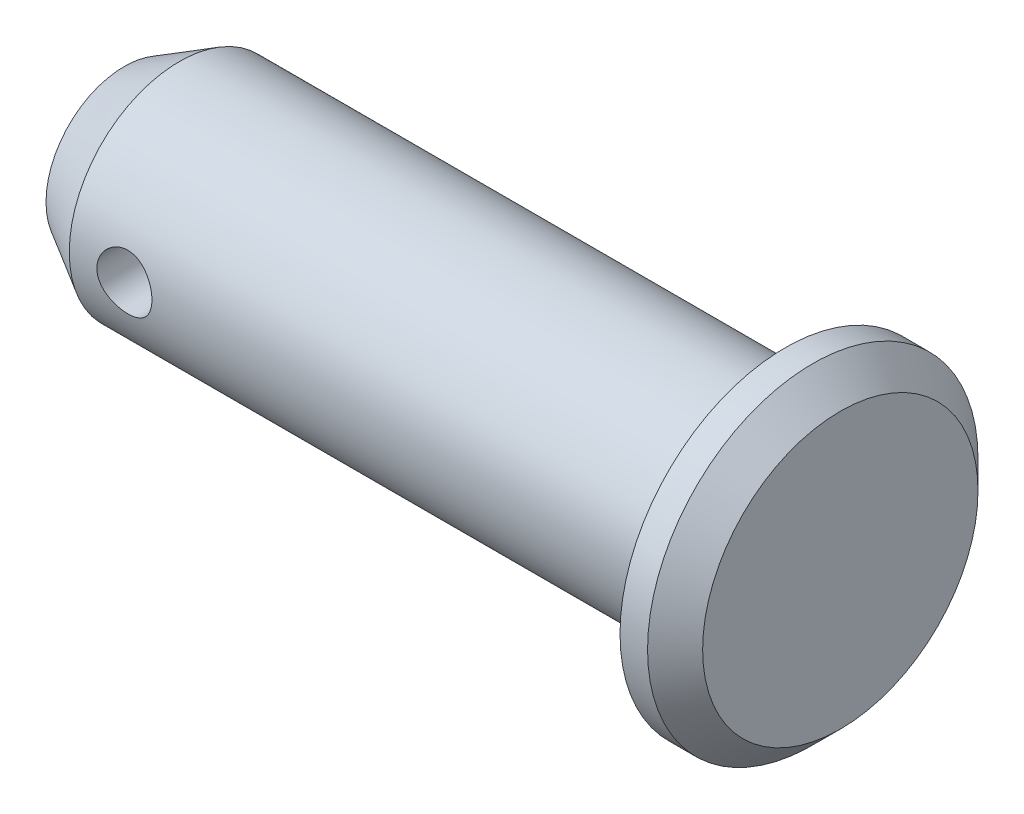
ISO-10303-21;
HEADER;
FILE_DESCRIPTION(('STEP AP214'),'2;1');
FILE_NAME('part.step','',(''),(''),'','','');
FILE_SCHEMA(('AUTOMOTIVE_DESIGN { 1 0 10303 214 1 1 1 1 }'));
ENDSEC;
DATA;
#1=APPLICATION_CONTEXT('core data for automotive mechanical design processes');
#2=APPLICATION_PROTOCOL_DEFINITION('international standard','automotive_design',2000,#1);
#3=PRODUCT_CONTEXT('',#1,'mechanical');
#4=PRODUCT('Part','Part','',(#3));
#5=PRODUCT_RELATED_PRODUCT_CATEGORY('part','',(#4));
#6=PRODUCT_DEFINITION_FORMATION('','',#4);
#7=PRODUCT_DEFINITION_CONTEXT('part definition',#1,'design');
#8=PRODUCT_DEFINITION('design','',#6,#7);
#9=PRODUCT_DEFINITION_SHAPE('','',#8);
#10=(LENGTH_UNIT() NAMED_UNIT(*) SI_UNIT(.MILLI.,.METRE.));
#11=(NAMED_UNIT(*) PLANE_ANGLE_UNIT() SI_UNIT($,.RADIAN.));
#12=(NAMED_UNIT(*) SI_UNIT($,.STERADIAN.) SOLID_ANGLE_UNIT());
#13=UNCERTAINTY_MEASURE_WITH_UNIT(LENGTH_MEASURE(1.E-05),#10,'distance_accuracy_value','');
#14=(GEOMETRIC_REPRESENTATION_CONTEXT(3) GLOBAL_UNCERTAINTY_ASSIGNED_CONTEXT((#13)) GLOBAL_UNIT_ASSIGNED_CONTEXT((#10,
#11,#12)) REPRESENTATION_CONTEXT('',''));
#15=CARTESIAN_POINT('',(0.,0.,0.));
#16=DIRECTION('',(0.,0.,1.));
#17=DIRECTION('',(1.,0.,0.));
#18=AXIS2_PLACEMENT_3D('',#15,#16,#17);
#19=CARTESIAN_POINT('',(-12.,0.,0.));
#20=DIRECTION('',(-1.,0.,0.));
#21=DIRECTION('',(0.,0.,1.));
#22=AXIS2_PLACEMENT_3D('',#19,#20,#21);
#23=PLANE('',#22);
#24=CARTESIAN_POINT('',(-12.,0.,0.));
#25=DIRECTION('',(-1.,0.,0.));
#26=DIRECTION('',(0.,0.,1.));
#27=AXIS2_PLACEMENT_3D('',#24,#25,#26);
#28=CIRCLE('',#27,1.42264973081037);
#29=CARTESIAN_POINT('',(-12.,0.,1.42264973081037));
#30=VERTEX_POINT('',#29);
#31=EDGE_CURVE('E10',#30,#30,#28,.T.);
#32=ORIENTED_EDGE('',*,*,#31,.T.);
#33=EDGE_LOOP('',(#32));
#34=FACE_BOUND('',#33,.T.);
#35=ADVANCED_FACE('F30',(#34),#23,.T.);
#36=CARTESIAN_POINT('',(0.,0.,0.));
#37=DIRECTION('',(1.,0.,0.));
#38=DIRECTION('',(0.,0.,-1.));
#39=AXIS2_PLACEMENT_3D('',#36,#37,#38);
#40=CYLINDRICAL_SURFACE('',#39,2.);
#41=CARTESIAN_POINT('',(-10.5,0.,-2.));
#42=CARTESIAN_POINT('',(-10.4999992247539,0.0276253628899105,-1.99999953289337));
#43=CARTESIAN_POINT('',(-10.4977028164087,0.055259385943588,-1.99942192710609));
#44=CARTESIAN_POINT('',(-10.488591616231,0.109735441256845,-1.99717371276631));
#45=CARTESIAN_POINT('',(-10.4817742634874,0.13657701562358,-1.99550248473323));
#46=CARTESIAN_POINT('',(-10.4638535821793,0.188673624060859,-1.99125208777346));
#47=CARTESIAN_POINT('',(-10.4527554004282,0.213930521143335,-1.98867400947362));
#48=CARTESIAN_POINT('',(-10.4266062033184,0.262224043968143,-1.98288447935864));
#49=CARTESIAN_POINT('',(-10.411555054627,0.285260594782921,-1.97967300618017));
#50=CARTESIAN_POINT('',(-10.3775997367819,0.328933975766974,-1.97289137863934));
#51=CARTESIAN_POINT('',(-10.3586294750136,0.349518563353691,-1.96931569049511));
#52=CARTESIAN_POINT('',(-10.317515931697,0.387249642401101,-1.96224540039176));
#53=CARTESIAN_POINT('',(-10.2953722923512,0.404395745649712,-1.95875080762783));
#54=CARTESIAN_POINT('',(-10.2481349244209,0.435008847599677,-1.9521825856657));
#55=CARTESIAN_POINT('',(-10.2230022563965,0.448417405308452,-1.94911598156868));
#56=CARTESIAN_POINT('',(-10.1707505294472,0.470798969516842,-1.94383164937408));
#57=CARTESIAN_POINT('',(-10.1436317888914,0.479772685146444,-1.94161378557596));
#58=CARTESIAN_POINT('',(-10.0887521672658,0.492851612268096,-1.93833492239184));
#59=CARTESIAN_POINT('',(-10.0610150346501,0.497050756111112,-1.93725163691809));
#60=CARTESIAN_POINT('',(-10.0052104769953,0.500753925022617,-1.9362978751258));
#61=CARTESIAN_POINT('',(-9.9771431064338,0.500258713939325,-1.93642720149548));
#62=CARTESIAN_POINT('',(-9.92219473075184,0.49466217487976,-1.93786401832206));
#63=CARTESIAN_POINT('',(-9.89530145951163,0.489672780063506,-1.93914287667293));
#64=CARTESIAN_POINT('',(-9.8427463163629,0.475408062301034,-1.94268903225494));
#65=CARTESIAN_POINT('',(-9.81708453232367,0.46613243402314,-1.94495639990232));
#66=CARTESIAN_POINT('',(-9.76742066124931,0.443463159312383,-1.95025037968062));
#67=CARTESIAN_POINT('',(-9.74343794273682,0.430028889077636,-1.95328442489807));
#68=CARTESIAN_POINT('',(-9.69802709674772,0.399452092004983,-1.95976570282129));
#69=CARTESIAN_POINT('',(-9.67659941731091,0.382308916269611,-1.96321300778245));
#70=CARTESIAN_POINT('',(-9.6362654614352,0.344221141560403,-1.9702529351326));
#71=CARTESIAN_POINT('',(-9.61744850331288,0.323182086055284,-1.9738468982599));
#72=CARTESIAN_POINT('',(-9.5835929191787,0.278203972501231,-1.98068655192929));
#73=CARTESIAN_POINT('',(-9.56855440857881,0.254264825902645,-1.98393223183138));
#74=CARTESIAN_POINT('',(-9.54264980459187,0.204038629560461,-1.98972577364727));
#75=CARTESIAN_POINT('',(-9.53179821991519,0.177743797736205,-1.99227120042575));
#76=CARTESIAN_POINT('',(-9.51469423143014,0.123625336047625,-1.99635972330473));
#77=CARTESIAN_POINT('',(-9.50844094786062,0.095801999716825,-1.99790301113094));
#78=CARTESIAN_POINT('',(-9.50084747814706,0.0401799901300055,-1.99978499757125));
#79=CARTESIAN_POINT('',(-9.4993856579749,0.0123989066627333,-2.00015351169426));
#80=CARTESIAN_POINT('',(-9.50108300068516,-0.0430109582671725,-1.9997293493815));
#81=CARTESIAN_POINT('',(-9.50424174759971,-0.0706397532148682,-1.99893677747282));
#82=CARTESIAN_POINT('',(-9.51499030279713,-0.124538089592167,-1.99629860375786));
#83=CARTESIAN_POINT('',(-9.52251375449233,-0.150821706322921,-1.99446878061937));
#84=CARTESIAN_POINT('',(-9.54170236134282,-0.201752430817506,-1.98996235544711));
#85=CARTESIAN_POINT('',(-9.55336793477106,-0.226399373010881,-1.98728566789964));
#86=CARTESIAN_POINT('',(-9.58074537629158,-0.273841044809952,-1.98131102642103));
#87=CARTESIAN_POINT('',(-9.59652537079892,-0.296595147278613,-1.97800289122311));
#88=CARTESIAN_POINT('',(-9.63159663626566,-0.339175537881085,-1.97114836395806));
#89=CARTESIAN_POINT('',(-9.65088851320564,-0.359001319657672,-1.96760193083901));
#90=CARTESIAN_POINT('',(-9.69300065361482,-0.395663522690913,-1.96056318986924));
#91=CARTESIAN_POINT('',(-9.71589590100081,-0.41241462254068,-1.95707434729093));
#92=CARTESIAN_POINT('',(-9.76424421148858,-0.441836919670902,-1.95064292792413));
#93=CARTESIAN_POINT('',(-9.78969716098659,-0.454508298052648,-1.94770032689009));
#94=CARTESIAN_POINT('',(-9.84230190747103,-0.4753171402031,-1.94272698244888));
#95=CARTESIAN_POINT('',(-9.86944254278134,-0.483481465551357,-1.94069085097302));
#96=CARTESIAN_POINT('',(-9.92476987929637,-0.495115219984595,-1.93775581363394));
#97=CARTESIAN_POINT('',(-9.95295635034417,-0.498585675826221,-1.93685665906645));
#98=CARTESIAN_POINT('',(-10.0087070079517,-0.500679530111333,-1.93631633734652));
#99=CARTESIAN_POINT('',(-10.0362658117082,-0.499439299260041,-1.93663977576088));
#100=CARTESIAN_POINT('',(-10.0907679628893,-0.492459092770957,-1.93842636335947));
#101=CARTESIAN_POINT('',(-10.1177113226712,-0.486719207562258,-1.93988948963952));
#102=CARTESIAN_POINT('',(-10.1700694863551,-0.470977106480933,-1.94377086894241));
#103=CARTESIAN_POINT('',(-10.1954924350801,-0.461000468226793,-1.94618338412103));
#104=CARTESIAN_POINT('',(-10.2443217942379,-0.437088304535024,-1.95169251908276));
#105=CARTESIAN_POINT('',(-10.2677279243956,-0.423152230011397,-1.95478923373591));
#106=CARTESIAN_POINT('',(-10.3125182096673,-0.391289249545713,-1.96141878087837));
#107=CARTESIAN_POINT('',(-10.3338336911413,-0.373267720970752,-1.96496088277252));
#108=CARTESIAN_POINT('',(-10.3731823482651,-0.333929790396579,-1.97202675748762));
#109=CARTESIAN_POINT('',(-10.391214743371,-0.31261260708705,-1.97555052575686));
#110=CARTESIAN_POINT('',(-10.4238037695215,-0.266822528900865,-1.98225885215888));
#111=CARTESIAN_POINT('',(-10.4382915378905,-0.242299474105463,-1.98543611121956));
#112=CARTESIAN_POINT('',(-10.4629158209802,-0.191088686503492,-1.99101641658373));
#113=CARTESIAN_POINT('',(-10.4730554535495,-0.164402521145579,-1.9934200173326));
#114=CARTESIAN_POINT('',(-10.4871906101099,-0.114803417747823,-1.99682686521847));
#115=CARTESIAN_POINT('',(-10.4919837476845,-0.0921267236360225,-1.9980086168423));
#116=CARTESIAN_POINT('',(-10.498388647874,-0.0463020238454276,-1.99959535077316));
#117=CARTESIAN_POINT('',(-10.5000006497684,-0.0231540537475387,-2.00000039150298));
#118=CARTESIAN_POINT('',(-10.5,0.,-2.));
#119=B_SPLINE_CURVE_WITH_KNOTS('',3,(#41,#42,#43,#44,#45,#46,#47,#48,#49,#50,#51,#52,#53,#54,
#55,#56,#57,#58,#59,#60,#61,#62,#63,#64,#65,#66,#67,#68,#69,#70,#71,#72,#73,#74,#75,#76,#77,#78,
#79,#80,#81,#82,#83,#84,#85,#86,#87,#88,#89,#90,#91,#92,#93,#94,#95,#96,#97,#98,#99,#100,#101,
#102,#103,#104,#105,#106,#107,#108,#109,#110,#111,#112,#113,#114,#115,#116,#117,#118),
.UNSPECIFIED.,.T.,.F.,(4,2,2,2,2,2,2,2,2,2,2,2,2,2,2,2,2,2,2,2,2,2,2,2,2,2,2,2,2,2,2,2,2,2,2,2,
2,2,4),(0.,0.0827912374906302,0.165629412587967,0.248368300762036,0.331109980056443,
0.41538145145713,0.499662431933539,0.585195491819355,0.670714870564562,0.754520983664769,
0.838313460375657,0.920074990023396,1.0018423448868,1.08443509291293,1.16704230278721,
1.25200500323007,1.33697029852749,1.42222743003038,1.50746824562881,1.59052769649759,
1.67357967037581,1.75540091504679,1.83723042440764,1.92051195855117,2.0038078766934,
2.08914836401492,2.17448506249836,2.25930751538012,2.34411141084136,2.42647926799538,
2.50884546985345,2.59072133519816,2.67260856045634,2.75663192136637,2.84067523256806,
2.92624061833196,3.01174454607117,3.08114080980717,3.1505318534768),.UNSPECIFIED.);
#120=CARTESIAN_POINT('',(-10.5,0.,-2.));
#121=VERTEX_POINT('',#120);
#122=EDGE_CURVE('E34',#121,#121,#119,.T.);
#123=ORIENTED_EDGE('',*,*,#122,.F.);
#124=EDGE_LOOP('',(#123));
#125=FACE_BOUND('',#124,.T.);
#126=CARTESIAN_POINT('',(-9.5,0.,2.));
#127=CARTESIAN_POINT('',(-9.50000077524605,0.0276253628899091,1.99999953289337));
#128=CARTESIAN_POINT('',(-9.50229718359127,0.0552593859435864,1.99942192710609));
#129=CARTESIAN_POINT('',(-9.511408383769,0.109735441256843,1.99717371276631));
#130=CARTESIAN_POINT('',(-9.51822573651262,0.136577015623579,1.99550248473323));
#131=CARTESIAN_POINT('',(-9.5361464178207,0.188673624060858,1.99125208777347));
#132=CARTESIAN_POINT('',(-9.54724459957176,0.213930521143333,1.98867400947362));
#133=CARTESIAN_POINT('',(-9.57339379668161,0.262224043968141,1.98288447935864));
#134=CARTESIAN_POINT('',(-9.58844494537298,0.285260594782918,1.97967300618017));
#135=CARTESIAN_POINT('',(-9.62240026321807,0.328933975766972,1.97289137863934));
#136=CARTESIAN_POINT('',(-9.64137052498639,0.349518563353689,1.96931569049511));
#137=CARTESIAN_POINT('',(-9.68248406830297,0.3872496424011,1.96224540039176));
#138=CARTESIAN_POINT('',(-9.70462770764883,0.40439574564971,1.95875080762783));
#139=CARTESIAN_POINT('',(-9.75186507557915,0.435008847599676,1.9521825856657));
#140=CARTESIAN_POINT('',(-9.77699774360347,0.448417405308451,1.94911598156868));
#141=CARTESIAN_POINT('',(-9.82924947055279,0.470798969516841,1.94383164937408));
#142=CARTESIAN_POINT('',(-9.85636821110859,0.479772685146443,1.94161378557596));
#143=CARTESIAN_POINT('',(-9.91124783273416,0.492851612268096,1.93833492239184));
#144=CARTESIAN_POINT('',(-9.93898496534993,0.497050756111112,1.93725163691809));
#145=CARTESIAN_POINT('',(-9.99478952300466,0.500753925022617,1.9362978751258));
#146=CARTESIAN_POINT('',(-10.0228568935662,0.500258713939325,1.93642720149548));
#147=CARTESIAN_POINT('',(-10.0778052692482,0.49466217487976,1.93786401832206));
#148=CARTESIAN_POINT('',(-10.1046985404884,0.489672780063506,1.93914287667293));
#149=CARTESIAN_POINT('',(-10.1572536836371,0.475408062301035,1.94268903225494));
#150=CARTESIAN_POINT('',(-10.1829154676763,0.466132434023141,1.94495639990232));
#151=CARTESIAN_POINT('',(-10.2325793387507,0.443463159312384,1.95025037968062));
#152=CARTESIAN_POINT('',(-10.2565620572632,0.430028889077636,1.95328442489807));
#153=CARTESIAN_POINT('',(-10.3019729032523,0.399452092004984,1.95976570282129));
#154=CARTESIAN_POINT('',(-10.3234005826891,0.382308916269612,1.96321300778245));
#155=CARTESIAN_POINT('',(-10.3637345385648,0.344221141560405,1.9702529351326));
#156=CARTESIAN_POINT('',(-10.3825514966871,0.323182086055285,1.9738468982599));
#157=CARTESIAN_POINT('',(-10.4164070808213,0.278203972501232,1.98068655192929));
#158=CARTESIAN_POINT('',(-10.4314455914212,0.254264825902647,1.98393223183138));
#159=CARTESIAN_POINT('',(-10.4573501954081,0.204038629560464,1.98972577364727));
#160=CARTESIAN_POINT('',(-10.4682017800848,0.177743797736207,1.99227120042575));
#161=CARTESIAN_POINT('',(-10.4853057685699,0.123625336047627,1.99635972330473));
#162=CARTESIAN_POINT('',(-10.4915590521394,0.095801999716827,1.99790301113093));
#163=CARTESIAN_POINT('',(-10.4991525218529,0.0401799901300075,1.99978499757125));
#164=CARTESIAN_POINT('',(-10.5006143420251,0.0123989066627351,2.00015351169426));
#165=CARTESIAN_POINT('',(-10.4989169993148,-0.0430109582671708,1.9997293493815));
#166=CARTESIAN_POINT('',(-10.4957582524003,-0.0706397532148663,1.99893677747282));
#167=CARTESIAN_POINT('',(-10.4850096972029,-0.124538089592165,1.99629860375786));
#168=CARTESIAN_POINT('',(-10.4774862455077,-0.150821706322919,1.99446878061937));
#169=CARTESIAN_POINT('',(-10.4582976386572,-0.201752430817505,1.98996235544711));
#170=CARTESIAN_POINT('',(-10.4466320652289,-0.226399373010879,1.98728566789964));
#171=CARTESIAN_POINT('',(-10.4192546237084,-0.27384104480995,1.98131102642103));
#172=CARTESIAN_POINT('',(-10.4034746292011,-0.296595147278611,1.97800289122311));
#173=CARTESIAN_POINT('',(-10.3684033637343,-0.339175537881084,1.97114836395806));
#174=CARTESIAN_POINT('',(-10.3491114867944,-0.359001319657671,1.96760193083901));
#175=CARTESIAN_POINT('',(-10.3069993463852,-0.395663522690912,1.96056318986924));
#176=CARTESIAN_POINT('',(-10.2841040989992,-0.412414622540679,1.95707434729094));
#177=CARTESIAN_POINT('',(-10.2357557885114,-0.441836919670901,1.95064292792413));
#178=CARTESIAN_POINT('',(-10.2103028390134,-0.454508298052647,1.94770032689009));
#179=CARTESIAN_POINT('',(-10.157698092529,-0.475317140203099,1.94272698244888));
#180=CARTESIAN_POINT('',(-10.1305574572187,-0.483481465551357,1.94069085097302));
#181=CARTESIAN_POINT('',(-10.0752301207036,-0.495115219984595,1.93775581363394));
#182=CARTESIAN_POINT('',(-10.0470436496558,-0.498585675826221,1.93685665906645));
#183=CARTESIAN_POINT('',(-9.99129299204827,-0.500679530111333,1.93631633734652));
#184=CARTESIAN_POINT('',(-9.96373418829176,-0.499439299260041,1.93663977576088));
#185=CARTESIAN_POINT('',(-9.90923203711067,-0.492459092770958,1.93842636335947));
#186=CARTESIAN_POINT('',(-9.88228867732878,-0.486719207562258,1.93988948963952));
#187=CARTESIAN_POINT('',(-9.82993051364487,-0.470977106480934,1.94377086894241));
#188=CARTESIAN_POINT('',(-9.80450756491993,-0.461000468226794,1.94618338412103));
#189=CARTESIAN_POINT('',(-9.75567820576211,-0.437088304535026,1.95169251908276));
#190=CARTESIAN_POINT('',(-9.73227207560436,-0.423152230011398,1.95478923373591));
#191=CARTESIAN_POINT('',(-9.68748179033266,-0.391289249545714,1.96141878087837));
#192=CARTESIAN_POINT('',(-9.66616630885868,-0.373267720970754,1.96496088277252));
#193=CARTESIAN_POINT('',(-9.62681765173487,-0.333929790396581,1.97202675748762));
#194=CARTESIAN_POINT('',(-9.60878525662901,-0.31261260708705,1.97555052575686));
#195=CARTESIAN_POINT('',(-9.57619623047847,-0.266822528900865,1.98225885215888));
#196=CARTESIAN_POINT('',(-9.56170846210947,-0.242299474105464,1.98543611121956));
#197=CARTESIAN_POINT('',(-9.53708417901982,-0.191088686503493,1.99101641658373));
#198=CARTESIAN_POINT('',(-9.52694454645049,-0.164402521145581,1.9934200173326));
#199=CARTESIAN_POINT('',(-9.51280938989012,-0.114803417747825,1.99682686521847));
#200=CARTESIAN_POINT('',(-9.50801625231552,-0.0921267236360241,1.9980086168423));
#201=CARTESIAN_POINT('',(-9.50161135212602,-0.046302023845429,1.99959535077316));
#202=CARTESIAN_POINT('',(-9.49999935023157,-0.02315405374754,2.00000039150298));
#203=CARTESIAN_POINT('',(-9.5,0.,2.));
#204=B_SPLINE_CURVE_WITH_KNOTS('',3,(#126,#127,#128,#129,#130,#131,#132,#133,#134,#135,#136,
#137,#138,#139,#140,#141,#142,#143,#144,#145,#146,#147,#148,#149,#150,#151,#152,#153,#154,#155,
#156,#157,#158,#159,#160,#161,#162,#163,#164,#165,#166,#167,#168,#169,#170,#171,#172,#173,#174,
#175,#176,#177,#178,#179,#180,#181,#182,#183,#184,#185,#186,#187,#188,#189,#190,#191,#192,#193,
#194,#195,#196,#197,#198,#199,#200,#201,#202,#203),.UNSPECIFIED.,.T.,.F.,(4,2,2,2,2,2,2,2,2,2,2,
2,2,2,2,2,2,2,2,2,2,2,2,2,2,2,2,2,2,2,2,2,2,2,2,2,2,2,4),(0.,0.0827912374906297,
0.165629412587966,0.248368300762035,0.331109980056443,0.415381451457129,0.499662431933539,
0.585195491819355,0.670714870564561,0.75452098366477,0.838313460375658,0.920074990023394,
1.0018423448868,1.08443509291293,1.16704230278721,1.25200500323007,1.33697029852749,
1.42222743003038,1.50746824562881,1.59052769649759,1.67357967037581,1.75540091504679,
1.83723042440764,1.92051195855117,2.0038078766934,2.08914836401492,2.17448506249836,
2.25930751538012,2.34411141084136,2.42647926799538,2.50884546985345,2.59072133519816,
2.67260856045634,2.75663192136637,2.84067523256806,2.92624061833196,3.01174454607117,
3.08114080980717,3.1505318534768),.UNSPECIFIED.);
#205=CARTESIAN_POINT('',(-9.5,0.,2.));
#206=VERTEX_POINT('',#205);
#207=EDGE_CURVE('E51',#206,#206,#204,.T.);
#208=ORIENTED_EDGE('',*,*,#207,.F.);
#209=EDGE_LOOP('',(#208));
#210=FACE_BOUND('',#209,.T.);
#211=CARTESIAN_POINT('',(-11.,0.,0.));
#212=DIRECTION('',(-1.,0.,0.));
#213=DIRECTION('',(0.,0.,1.));
#214=AXIS2_PLACEMENT_3D('',#211,#212,#213);
#215=CIRCLE('',#214,2.);
#216=CARTESIAN_POINT('',(-11.,0.,2.));
#217=VERTEX_POINT('',#216);
#218=EDGE_CURVE('E43',#217,#217,#215,.F.);
#219=ORIENTED_EDGE('',*,*,#218,.T.);
#220=EDGE_LOOP('',(#219));
#221=FACE_BOUND('',#220,.T.);
#222=CARTESIAN_POINT('',(0.,0.,0.));
#223=DIRECTION('',(1.,0.,0.));
#224=DIRECTION('',(0.,0.,-1.));
#225=AXIS2_PLACEMENT_3D('',#222,#223,#224);
#226=CIRCLE('',#225,2.);
#227=CARTESIAN_POINT('',(0.,0.,-2.));
#228=VERTEX_POINT('',#227);
#229=EDGE_CURVE('E48',#228,#228,#226,.T.);
#230=ORIENTED_EDGE('',*,*,#229,.F.);
#231=EDGE_LOOP('',(#230));
#232=FACE_BOUND('',#231,.T.);
#233=ADVANCED_FACE('F56',(#125,#210,#221,#232),#40,.T.);
#234=CARTESIAN_POINT('',(0.,0.,0.));
#235=DIRECTION('',(1.,0.,0.));
#236=DIRECTION('',(0.,0.,-1.));
#237=AXIS2_PLACEMENT_3D('',#234,#235,#236);
#238=PLANE('',#237);
#239=ORIENTED_EDGE('',*,*,#229,.T.);
#240=EDGE_LOOP('',(#239));
#241=FACE_BOUND('',#240,.T.);
#242=CARTESIAN_POINT('',(0.,0.,0.));
#243=DIRECTION('',(-1.,0.,0.));
#244=DIRECTION('',(0.,0.,1.));
#245=AXIS2_PLACEMENT_3D('',#242,#243,#244);
#246=CIRCLE('',#245,3.);
#247=CARTESIAN_POINT('',(0.,0.,3.));
#248=VERTEX_POINT('',#247);
#249=EDGE_CURVE('E137',#248,#248,#246,.T.);
#250=ORIENTED_EDGE('',*,*,#249,.T.);
#251=EDGE_LOOP('',(#250));
#252=FACE_BOUND('',#251,.T.);
#253=ADVANCED_FACE('F75',(#241,#252),#238,.F.);
#254=CARTESIAN_POINT('',(0.,0.,0.));
#255=DIRECTION('',(-1.,0.,0.));
#256=DIRECTION('',(0.,0.,1.));
#257=AXIS2_PLACEMENT_3D('',#254,#255,#256);
#258=CYLINDRICAL_SURFACE('',#257,3.);
#259=ORIENTED_EDGE('',*,*,#249,.F.);
#260=EDGE_LOOP('',(#259));
#261=FACE_BOUND('',#260,.T.);
#262=CARTESIAN_POINT('',(0.5,0.,0.));
#263=DIRECTION('',(-1.,0.,0.));
#264=DIRECTION('',(0.,0.,1.));
#265=AXIS2_PLACEMENT_3D('',#262,#263,#264);
#266=CIRCLE('',#265,3.);
#267=CARTESIAN_POINT('',(0.5,0.,3.));
#268=VERTEX_POINT('',#267);
#269=EDGE_CURVE('E139',#268,#268,#266,.T.);
#270=ORIENTED_EDGE('',*,*,#269,.T.);
#271=EDGE_LOOP('',(#270));
#272=FACE_BOUND('',#271,.T.);
#273=ADVANCED_FACE('F72',(#261,#272),#258,.T.);
#274=CARTESIAN_POINT('',(1.,0.,0.));
#275=DIRECTION('',(-1.,0.,0.));
#276=DIRECTION('',(0.,0.,1.));
#277=AXIS2_PLACEMENT_3D('',#274,#275,#276);
#278=CONICAL_SURFACE('',#277,2.5,0.785398163397448);
#279=ORIENTED_EDGE('',*,*,#269,.F.);
#280=EDGE_LOOP('',(#279));
#281=FACE_BOUND('',#280,.T.);
#282=CARTESIAN_POINT('',(1.,0.,0.));
#283=DIRECTION('',(-1.,0.,0.));
#284=DIRECTION('',(0.,0.,1.));
#285=AXIS2_PLACEMENT_3D('',#282,#283,#284);
#286=CIRCLE('',#285,2.5);
#287=CARTESIAN_POINT('',(1.,0.,2.5));
#288=VERTEX_POINT('',#287);
#289=EDGE_CURVE('E144',#288,#288,#286,.T.);
#290=ORIENTED_EDGE('',*,*,#289,.T.);
#291=EDGE_LOOP('',(#290));
#292=FACE_BOUND('',#291,.T.);
#293=ADVANCED_FACE('F68',(#281,#292),#278,.T.);
#294=CARTESIAN_POINT('',(1.,0.,0.));
#295=DIRECTION('',(-1.,0.,0.));
#296=DIRECTION('',(0.,0.,1.));
#297=AXIS2_PLACEMENT_3D('',#294,#295,#296);
#298=PLANE('',#297);
#299=ORIENTED_EDGE('',*,*,#289,.F.);
#300=EDGE_LOOP('',(#299));
#301=FACE_BOUND('',#300,.T.);
#302=ADVANCED_FACE('F64',(#301),#298,.F.);
#303=CARTESIAN_POINT('',(-11.,0.,0.));
#304=DIRECTION('',(1.,0.,0.));
#305=DIRECTION('',(0.,0.,-1.));
#306=AXIS2_PLACEMENT_3D('',#303,#304,#305);
#307=CONICAL_SURFACE('',#306,2.,0.523598775598296);
#308=ORIENTED_EDGE('',*,*,#31,.F.);
#309=EDGE_LOOP('',(#308));
#310=FACE_BOUND('',#309,.T.);
#311=ORIENTED_EDGE('',*,*,#218,.F.);
#312=EDGE_LOOP('',(#311));
#313=FACE_BOUND('',#312,.T.);
#314=ADVANCED_FACE('F32',(#310,#313),#307,.T.);
#315=CARTESIAN_POINT('',(-10.,0.,-3.));
#316=DIRECTION('',(0.,0.,1.));
#317=DIRECTION('',(1.,0.,0.));
#318=AXIS2_PLACEMENT_3D('',#315,#316,#317);
#319=CYLINDRICAL_SURFACE('',#318,0.500000000000001);
#320=ORIENTED_EDGE('',*,*,#122,.T.);
#321=EDGE_LOOP('',(#320));
#322=FACE_BOUND('',#321,.T.);
#323=ORIENTED_EDGE('',*,*,#207,.T.);
#324=EDGE_LOOP('',(#323));
#325=FACE_BOUND('',#324,.T.);
#326=ADVANCED_FACE('F59',(#322,#325),#319,.F.);
#327=CLOSED_SHELL('',(#35,#233,#253,#273,#293,#302,#314,#326));
#328=MANIFOLD_SOLID_BREP('B2',#327);
#329=ADVANCED_BREP_SHAPE_REPRESENTATION('',(#18,#328),#14);
#330=SHAPE_DEFINITION_REPRESENTATION(#9,#329);
ENDSEC;
END-ISO-10303-21;
